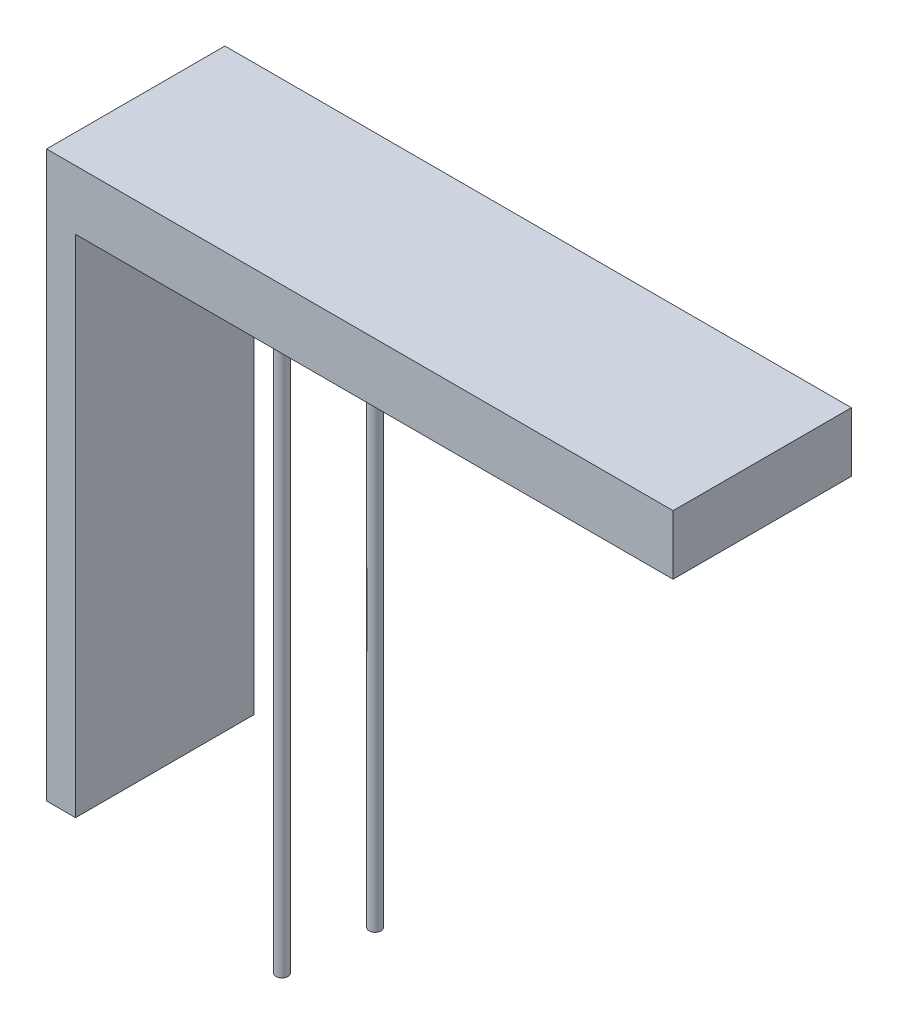
ISO-10303-21;
HEADER;
FILE_DESCRIPTION(('STEP AP214'),'2;1');
FILE_NAME('part.step','',(''),(''),'','','');
FILE_SCHEMA(('AUTOMOTIVE_DESIGN { 1 0 10303 214 1 1 1 1 }'));
ENDSEC;
DATA;
#1=APPLICATION_CONTEXT('core data for automotive mechanical design processes');
#2=APPLICATION_PROTOCOL_DEFINITION('international standard','automotive_design',2000,#1);
#3=PRODUCT_CONTEXT('',#1,'mechanical');
#4=PRODUCT('Part','Part','',(#3));
#5=PRODUCT_RELATED_PRODUCT_CATEGORY('part','',(#4));
#6=PRODUCT_DEFINITION_FORMATION('','',#4);
#7=PRODUCT_DEFINITION_CONTEXT('part definition',#1,'design');
#8=PRODUCT_DEFINITION('design','',#6,#7);
#9=PRODUCT_DEFINITION_SHAPE('','',#8);
#10=(LENGTH_UNIT() NAMED_UNIT(*) SI_UNIT(.MILLI.,.METRE.));
#11=(NAMED_UNIT(*) PLANE_ANGLE_UNIT() SI_UNIT($,.RADIAN.));
#12=(NAMED_UNIT(*) SI_UNIT($,.STERADIAN.) SOLID_ANGLE_UNIT());
#13=UNCERTAINTY_MEASURE_WITH_UNIT(LENGTH_MEASURE(1.E-05),#10,'distance_accuracy_value','');
#14=(GEOMETRIC_REPRESENTATION_CONTEXT(3) GLOBAL_UNCERTAINTY_ASSIGNED_CONTEXT((#13)) GLOBAL_UNIT_ASSIGNED_CONTEXT((#10,
#11,#12)) REPRESENTATION_CONTEXT('',''));
#15=CARTESIAN_POINT('',(0.,0.,0.));
#16=DIRECTION('',(0.,0.,1.));
#17=DIRECTION('',(1.,0.,0.));
#18=AXIS2_PLACEMENT_3D('',#15,#16,#17);
#19=CARTESIAN_POINT('',(123.733692341845,31.5,6.));
#20=DIRECTION('',(0.,1.,0.));
#21=DIRECTION('',(0.,0.,1.));
#22=AXIS2_PLACEMENT_3D('',#19,#20,#21);
#23=PLANE('',#22);
#24=CARTESIAN_POINT('',(128.735391715577,31.5,4.05666075672298));
#25=DIRECTION('',(0.,1.,0.));
#26=DIRECTION('',(0.,0.,1.));
#27=AXIS2_PLACEMENT_3D('',#24,#25,#26);
#28=CIRCLE('',#27,0.200000000000016);
#29=CARTESIAN_POINT('',(128.735391715577,31.5,4.256660756723));
#30=VERTEX_POINT('',#29);
#31=EDGE_CURVE('E44',#30,#30,#28,.F.);
#32=ORIENTED_EDGE('',*,*,#31,.F.);
#33=EDGE_LOOP('',(#32));
#34=FACE_BOUND('',#33,.T.);
#35=DIRECTION('',(1.,0.,0.));
#36=VECTOR('',#35,1.);
#37=CARTESIAN_POINT('',(123.733692341845,31.5,0.));
#38=LINE('',#37,#36);
#39=CARTESIAN_POINT('',(123.733692341845,31.5,0.));
#40=VERTEX_POINT('',#39);
#41=CARTESIAN_POINT('',(143.838461576455,31.5,0.));
#42=VERTEX_POINT('',#41);
#43=EDGE_CURVE('E127',#40,#42,#38,.T.);
#44=ORIENTED_EDGE('',*,*,#43,.T.);
#45=DIRECTION('',(0.,0.,-1.));
#46=VECTOR('',#45,1.);
#47=CARTESIAN_POINT('',(143.838461576455,31.5,6.));
#48=LINE('',#47,#46);
#49=CARTESIAN_POINT('',(143.838461576455,31.5,6.));
#50=VERTEX_POINT('',#49);
#51=EDGE_CURVE('E112',#50,#42,#48,.T.);
#52=ORIENTED_EDGE('',*,*,#51,.F.);
#53=DIRECTION('',(1.,0.,0.));
#54=VECTOR('',#53,1.);
#55=CARTESIAN_POINT('',(123.733692341845,31.5,6.));
#56=LINE('',#55,#54);
#57=CARTESIAN_POINT('',(123.733692341845,31.5,6.));
#58=VERTEX_POINT('',#57);
#59=EDGE_CURVE('E103',#58,#50,#56,.T.);
#60=ORIENTED_EDGE('',*,*,#59,.F.);
#61=DIRECTION('',(0.,0.,-1.));
#62=VECTOR('',#61,1.);
#63=CARTESIAN_POINT('',(123.733692341845,31.5,6.));
#64=LINE('',#63,#62);
#65=EDGE_CURVE('E136',#58,#40,#64,.T.);
#66=ORIENTED_EDGE('',*,*,#65,.T.);
#67=EDGE_LOOP('',(#44,#52,#60,#66));
#68=FACE_BOUND('',#67,.T.);
#69=CARTESIAN_POINT('',(128.971557812376,31.5,1.15908441523015));
#70=DIRECTION('',(0.,1.,0.));
#71=DIRECTION('',(0.,0.,1.));
#72=AXIS2_PLACEMENT_3D('',#69,#70,#71);
#73=CIRCLE('',#72,0.200000000000016);
#74=CARTESIAN_POINT('',(128.971557812376,31.5,1.35908441523016));
#75=VERTEX_POINT('',#74);
#76=EDGE_CURVE('E11',#75,#75,#73,.F.);
#77=ORIENTED_EDGE('',*,*,#76,.F.);
#78=EDGE_LOOP('',(#77));
#79=FACE_BOUND('',#78,.T.);
#80=ADVANCED_FACE('F35',(#34,#68,#79),#23,.F.);
#81=CARTESIAN_POINT('',(123.733692341845,14.5,6.));
#82=DIRECTION('',(0.,1.,0.));
#83=DIRECTION('',(0.,0.,1.));
#84=AXIS2_PLACEMENT_3D('',#81,#82,#83);
#85=PLANE('',#84);
#86=DIRECTION('',(1.,0.,0.));
#87=VECTOR('',#86,1.);
#88=CARTESIAN_POINT('',(123.733692341845,14.5,0.));
#89=LINE('',#88,#87);
#90=CARTESIAN_POINT('',(122.759551822561,14.5,0.));
#91=VERTEX_POINT('',#90);
#92=CARTESIAN_POINT('',(123.733692341845,14.5,0.));
#93=VERTEX_POINT('',#92);
#94=EDGE_CURVE('E121',#91,#93,#89,.T.);
#95=ORIENTED_EDGE('',*,*,#94,.T.);
#96=DIRECTION('',(0.,0.,-1.));
#97=VECTOR('',#96,1.);
#98=CARTESIAN_POINT('',(123.733692341845,14.5,6.));
#99=LINE('',#98,#97);
#100=CARTESIAN_POINT('',(123.733692341845,14.5,6.));
#101=VERTEX_POINT('',#100);
#102=EDGE_CURVE('E139',#101,#93,#99,.T.);
#103=ORIENTED_EDGE('',*,*,#102,.F.);
#104=DIRECTION('',(1.,0.,0.));
#105=VECTOR('',#104,1.);
#106=CARTESIAN_POINT('',(123.733692341845,14.5,6.));
#107=LINE('',#106,#105);
#108=CARTESIAN_POINT('',(122.759551822561,14.5,6.));
#109=VERTEX_POINT('',#108);
#110=EDGE_CURVE('E132',#109,#101,#107,.T.);
#111=ORIENTED_EDGE('',*,*,#110,.F.);
#112=DIRECTION('',(0.,0.,-1.));
#113=VECTOR('',#112,1.);
#114=CARTESIAN_POINT('',(122.759551822561,14.5,6.));
#115=LINE('',#114,#113);
#116=EDGE_CURVE('E117',#109,#91,#115,.T.);
#117=ORIENTED_EDGE('',*,*,#116,.T.);
#118=EDGE_LOOP('',(#95,#103,#111,#117));
#119=FACE_BOUND('',#118,.T.);
#120=ADVANCED_FACE('F37',(#119),#85,.F.);
#121=CARTESIAN_POINT('',(123.733692341845,14.5,6.));
#122=DIRECTION('',(-1.,0.,0.));
#123=DIRECTION('',(0.,0.,1.));
#124=AXIS2_PLACEMENT_3D('',#121,#122,#123);
#125=PLANE('',#124);
#126=DIRECTION('',(0.,1.,0.));
#127=VECTOR('',#126,1.);
#128=CARTESIAN_POINT('',(123.733692341845,14.5,0.));
#129=LINE('',#128,#127);
#130=EDGE_CURVE('E124',#93,#40,#129,.T.);
#131=ORIENTED_EDGE('',*,*,#130,.T.);
#132=ORIENTED_EDGE('',*,*,#65,.F.);
#133=DIRECTION('',(0.,1.,0.));
#134=VECTOR('',#133,1.);
#135=CARTESIAN_POINT('',(123.733692341845,14.5,6.));
#136=LINE('',#135,#134);
#137=EDGE_CURVE('E90',#101,#58,#136,.T.);
#138=ORIENTED_EDGE('',*,*,#137,.F.);
#139=ORIENTED_EDGE('',*,*,#102,.T.);
#140=EDGE_LOOP('',(#131,#132,#138,#139));
#141=FACE_BOUND('',#140,.T.);
#142=ADVANCED_FACE('F183',(#141),#125,.F.);
#143=CARTESIAN_POINT('',(143.838461576455,31.5,6.));
#144=DIRECTION('',(-1.,0.,0.));
#145=DIRECTION('',(0.,0.,1.));
#146=AXIS2_PLACEMENT_3D('',#143,#144,#145);
#147=PLANE('',#146);
#148=DIRECTION('',(0.,1.,0.));
#149=VECTOR('',#148,1.);
#150=CARTESIAN_POINT('',(143.838461576455,31.5,0.));
#151=LINE('',#150,#149);
#152=CARTESIAN_POINT('',(143.838461576455,33.5,0.));
#153=VERTEX_POINT('',#152);
#154=EDGE_CURVE('E111',#42,#153,#151,.T.);
#155=ORIENTED_EDGE('',*,*,#154,.T.);
#156=DIRECTION('',(0.,0.,-1.));
#157=VECTOR('',#156,1.);
#158=CARTESIAN_POINT('',(143.838461576455,33.5,6.));
#159=LINE('',#158,#157);
#160=CARTESIAN_POINT('',(143.838461576455,33.5,6.));
#161=VERTEX_POINT('',#160);
#162=EDGE_CURVE('E108',#161,#153,#159,.T.);
#163=ORIENTED_EDGE('',*,*,#162,.F.);
#164=DIRECTION('',(0.,1.,0.));
#165=VECTOR('',#164,1.);
#166=CARTESIAN_POINT('',(143.838461576455,31.5,6.));
#167=LINE('',#166,#165);
#168=EDGE_CURVE('E97',#50,#161,#167,.T.);
#169=ORIENTED_EDGE('',*,*,#168,.F.);
#170=ORIENTED_EDGE('',*,*,#51,.T.);
#171=EDGE_LOOP('',(#155,#163,#169,#170));
#172=FACE_BOUND('',#171,.T.);
#173=ADVANCED_FACE('F109',(#172),#147,.F.);
#174=CARTESIAN_POINT('',(143.838461576455,33.5,6.));
#175=DIRECTION('',(0.,-1.,0.));
#176=DIRECTION('',(0.,0.,-1.));
#177=AXIS2_PLACEMENT_3D('',#174,#175,#176);
#178=PLANE('',#177);
#179=DIRECTION('',(-1.,0.,0.));
#180=VECTOR('',#179,1.);
#181=CARTESIAN_POINT('',(143.838461576455,33.5,0.));
#182=LINE('',#181,#180);
#183=CARTESIAN_POINT('',(122.759551822561,33.5,0.));
#184=VERTEX_POINT('',#183);
#185=EDGE_CURVE('E75',#153,#184,#182,.T.);
#186=ORIENTED_EDGE('',*,*,#185,.T.);
#187=DIRECTION('',(0.,0.,-1.));
#188=VECTOR('',#187,1.);
#189=CARTESIAN_POINT('',(122.759551822561,33.5,6.));
#190=LINE('',#189,#188);
#191=CARTESIAN_POINT('',(122.759551822561,33.5,6.));
#192=VERTEX_POINT('',#191);
#193=EDGE_CURVE('E113',#192,#184,#190,.T.);
#194=ORIENTED_EDGE('',*,*,#193,.F.);
#195=DIRECTION('',(-1.,0.,0.));
#196=VECTOR('',#195,1.);
#197=CARTESIAN_POINT('',(143.838461576455,33.5,6.));
#198=LINE('',#197,#196);
#199=EDGE_CURVE('E101',#161,#192,#198,.T.);
#200=ORIENTED_EDGE('',*,*,#199,.F.);
#201=ORIENTED_EDGE('',*,*,#162,.T.);
#202=EDGE_LOOP('',(#186,#194,#200,#201));
#203=FACE_BOUND('',#202,.T.);
#204=ADVANCED_FACE('F115',(#203),#178,.F.);
#205=CARTESIAN_POINT('',(122.759551822561,14.5,6.));
#206=DIRECTION('',(1.,0.,0.));
#207=DIRECTION('',(0.,0.,-1.));
#208=AXIS2_PLACEMENT_3D('',#205,#206,#207);
#209=PLANE('',#208);
#210=DIRECTION('',(0.,-1.,0.));
#211=VECTOR('',#210,1.);
#212=CARTESIAN_POINT('',(122.759551822561,14.5,0.));
#213=LINE('',#212,#211);
#214=EDGE_CURVE('E81',#184,#91,#213,.T.);
#215=ORIENTED_EDGE('',*,*,#214,.T.);
#216=ORIENTED_EDGE('',*,*,#116,.F.);
#217=DIRECTION('',(0.,-1.,0.));
#218=VECTOR('',#217,1.);
#219=CARTESIAN_POINT('',(122.759551822561,14.5,6.));
#220=LINE('',#219,#218);
#221=EDGE_CURVE('E52',#192,#109,#220,.T.);
#222=ORIENTED_EDGE('',*,*,#221,.F.);
#223=ORIENTED_EDGE('',*,*,#193,.T.);
#224=EDGE_LOOP('',(#215,#216,#222,#223));
#225=FACE_BOUND('',#224,.T.);
#226=ADVANCED_FACE('F174',(#225),#209,.F.);
#227=CARTESIAN_POINT('',(122.759551822561,14.5,6.));
#228=DIRECTION('',(0.,0.,-1.));
#229=DIRECTION('',(-1.,0.,0.));
#230=AXIS2_PLACEMENT_3D('',#227,#228,#229);
#231=PLANE('',#230);
#232=ORIENTED_EDGE('',*,*,#110,.T.);
#233=ORIENTED_EDGE('',*,*,#137,.T.);
#234=ORIENTED_EDGE('',*,*,#59,.T.);
#235=ORIENTED_EDGE('',*,*,#168,.T.);
#236=ORIENTED_EDGE('',*,*,#199,.T.);
#237=ORIENTED_EDGE('',*,*,#221,.T.);
#238=EDGE_LOOP('',(#232,#233,#234,#235,#236,#237));
#239=FACE_BOUND('',#238,.T.);
#240=ADVANCED_FACE('F99',(#239),#231,.F.);
#241=CARTESIAN_POINT('',(122.759551822561,14.5,0.));
#242=DIRECTION('',(0.,0.,-1.));
#243=DIRECTION('',(-1.,0.,0.));
#244=AXIS2_PLACEMENT_3D('',#241,#242,#243);
#245=PLANE('',#244);
#246=ORIENTED_EDGE('',*,*,#94,.F.);
#247=ORIENTED_EDGE('',*,*,#214,.F.);
#248=ORIENTED_EDGE('',*,*,#185,.F.);
#249=ORIENTED_EDGE('',*,*,#154,.F.);
#250=ORIENTED_EDGE('',*,*,#43,.F.);
#251=ORIENTED_EDGE('',*,*,#130,.F.);
#252=EDGE_LOOP('',(#246,#247,#248,#249,#250,#251));
#253=FACE_BOUND('',#252,.T.);
#254=ADVANCED_FACE('F170',(#253),#245,.T.);
#255=CARTESIAN_POINT('',(128.735391715577,11.5,4.05666075672298));
#256=DIRECTION('',(0.,1.,0.));
#257=DIRECTION('',(0.,0.,1.));
#258=AXIS2_PLACEMENT_3D('',#255,#256,#257);
#259=CYLINDRICAL_SURFACE('',#258,0.200000000000016);
#260=CARTESIAN_POINT('',(128.735391715577,11.5,4.05666075672298));
#261=DIRECTION('',(0.,-1.,0.));
#262=DIRECTION('',(0.,0.,-1.));
#263=AXIS2_PLACEMENT_3D('',#260,#261,#262);
#264=CIRCLE('',#263,0.200000000000016);
#265=CARTESIAN_POINT('',(128.735391715577,11.5,3.85666075672297));
#266=VERTEX_POINT('',#265);
#267=EDGE_CURVE('E125',#266,#266,#264,.T.);
#268=ORIENTED_EDGE('',*,*,#267,.F.);
#269=EDGE_LOOP('',(#268));
#270=FACE_BOUND('',#269,.T.);
#271=ORIENTED_EDGE('',*,*,#31,.T.);
#272=EDGE_LOOP('',(#271));
#273=FACE_BOUND('',#272,.T.);
#274=ADVANCED_FACE('F143',(#270,#273),#259,.T.);
#275=CARTESIAN_POINT('',(128.735391715577,11.5,4.05666075672298));
#276=DIRECTION('',(0.,-1.,0.));
#277=DIRECTION('',(0.,0.,-1.));
#278=AXIS2_PLACEMENT_3D('',#275,#276,#277);
#279=PLANE('',#278);
#280=ORIENTED_EDGE('',*,*,#267,.T.);
#281=EDGE_LOOP('',(#280));
#282=FACE_BOUND('',#281,.T.);
#283=ADVANCED_FACE('F155',(#282),#279,.T.);
#284=CARTESIAN_POINT('',(128.971557812376,11.5,1.15908441523015));
#285=DIRECTION('',(0.,1.,0.));
#286=DIRECTION('',(0.,0.,1.));
#287=AXIS2_PLACEMENT_3D('',#284,#285,#286);
#288=CYLINDRICAL_SURFACE('',#287,0.200000000000016);
#289=CARTESIAN_POINT('',(128.971557812376,11.5,1.15908441523015));
#290=DIRECTION('',(0.,-1.,0.));
#291=DIRECTION('',(0.,0.,-1.));
#292=AXIS2_PLACEMENT_3D('',#289,#290,#291);
#293=CIRCLE('',#292,0.200000000000016);
#294=CARTESIAN_POINT('',(128.971557812376,11.5,0.959084415230132));
#295=VERTEX_POINT('',#294);
#296=EDGE_CURVE('E197',#295,#295,#293,.T.);
#297=ORIENTED_EDGE('',*,*,#296,.F.);
#298=EDGE_LOOP('',(#297));
#299=FACE_BOUND('',#298,.T.);
#300=ORIENTED_EDGE('',*,*,#76,.T.);
#301=EDGE_LOOP('',(#300));
#302=FACE_BOUND('',#301,.T.);
#303=ADVANCED_FACE('F152',(#299,#302),#288,.T.);
#304=CARTESIAN_POINT('',(128.971557812376,11.5,1.15908441523015));
#305=DIRECTION('',(0.,-1.,0.));
#306=DIRECTION('',(0.,0.,-1.));
#307=AXIS2_PLACEMENT_3D('',#304,#305,#306);
#308=PLANE('',#307);
#309=ORIENTED_EDGE('',*,*,#296,.T.);
#310=EDGE_LOOP('',(#309));
#311=FACE_BOUND('',#310,.T.);
#312=ADVANCED_FACE('F154',(#311),#308,.T.);
#313=CLOSED_SHELL('',(#80,#120,#142,#173,#204,#226,#240,#254,#274,#283,#303,#312));
#314=MANIFOLD_SOLID_BREP('B2',#313);
#315=ADVANCED_BREP_SHAPE_REPRESENTATION('',(#18,#314),#14);
#316=SHAPE_DEFINITION_REPRESENTATION(#9,#315);
ENDSEC;
END-ISO-10303-21;
